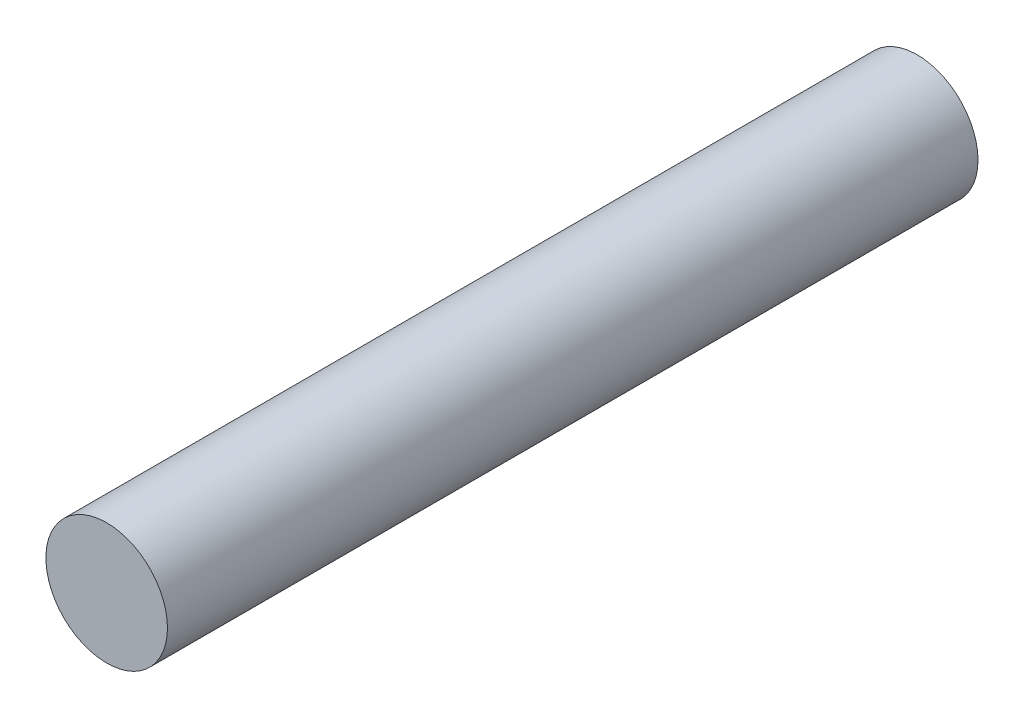
ISO-10303-21;
HEADER;
FILE_DESCRIPTION(('STEP AP214'),'2;1');
FILE_NAME('part.step','',(''),(''),'','','');
FILE_SCHEMA(('AUTOMOTIVE_DESIGN { 1 0 10303 214 1 1 1 1 }'));
ENDSEC;
DATA;
#1=APPLICATION_CONTEXT('core data for automotive mechanical design processes');
#2=APPLICATION_PROTOCOL_DEFINITION('international standard','automotive_design',2000,#1);
#3=PRODUCT_CONTEXT('',#1,'mechanical');
#4=PRODUCT('Part','Part','',(#3));
#5=PRODUCT_RELATED_PRODUCT_CATEGORY('part','',(#4));
#6=PRODUCT_DEFINITION_FORMATION('','',#4);
#7=PRODUCT_DEFINITION_CONTEXT('part definition',#1,'design');
#8=PRODUCT_DEFINITION('design','',#6,#7);
#9=PRODUCT_DEFINITION_SHAPE('','',#8);
#10=(LENGTH_UNIT() NAMED_UNIT(*) SI_UNIT(.MILLI.,.METRE.));
#11=(NAMED_UNIT(*) PLANE_ANGLE_UNIT() SI_UNIT($,.RADIAN.));
#12=(NAMED_UNIT(*) SI_UNIT($,.STERADIAN.) SOLID_ANGLE_UNIT());
#13=UNCERTAINTY_MEASURE_WITH_UNIT(LENGTH_MEASURE(1.E-05),#10,'distance_accuracy_value','');
#14=(GEOMETRIC_REPRESENTATION_CONTEXT(3) GLOBAL_UNCERTAINTY_ASSIGNED_CONTEXT((#13)) GLOBAL_UNIT_ASSIGNED_CONTEXT((#10,
#11,#12)) REPRESENTATION_CONTEXT('',''));
#15=CARTESIAN_POINT('',(0.,0.,0.));
#16=DIRECTION('',(0.,0.,1.));
#17=DIRECTION('',(1.,0.,0.));
#18=AXIS2_PLACEMENT_3D('',#15,#16,#17);
#19=CARTESIAN_POINT('',(0.,0.,-20.));
#20=DIRECTION('',(0.,0.,1.));
#21=DIRECTION('',(-1.,0.,0.));
#22=AXIS2_PLACEMENT_3D('',#19,#20,#21);
#23=CYLINDRICAL_SURFACE('',#22,1.5);
#24=CARTESIAN_POINT('',(0.,0.,-20.));
#25=DIRECTION('',(0.,0.,1.));
#26=DIRECTION('',(1.,0.,0.));
#27=AXIS2_PLACEMENT_3D('',#24,#25,#26);
#28=CIRCLE('',#27,1.5);
#29=CARTESIAN_POINT('',(1.5,0.,-20.));
#30=VERTEX_POINT('',#29);
#31=EDGE_CURVE('E10',#30,#30,#28,.T.);
#32=ORIENTED_EDGE('',*,*,#31,.T.);
#33=EDGE_LOOP('',(#32));
#34=FACE_BOUND('',#33,.T.);
#35=CARTESIAN_POINT('',(0.,0.,0.));
#36=DIRECTION('',(0.,0.,1.));
#37=DIRECTION('',(1.,0.,0.));
#38=AXIS2_PLACEMENT_3D('',#35,#36,#37);
#39=CIRCLE('',#38,1.5);
#40=CARTESIAN_POINT('',(1.5,0.,0.));
#41=VERTEX_POINT('',#40);
#42=EDGE_CURVE('E36',#41,#41,#39,.T.);
#43=ORIENTED_EDGE('',*,*,#42,.F.);
#44=EDGE_LOOP('',(#43));
#45=FACE_BOUND('',#44,.T.);
#46=ADVANCED_FACE('F33',(#34,#45),#23,.T.);
#47=CARTESIAN_POINT('',(0.,0.,-20.));
#48=DIRECTION('',(0.,0.,-1.));
#49=DIRECTION('',(1.,0.,0.));
#50=AXIS2_PLACEMENT_3D('',#47,#48,#49);
#51=PLANE('',#50);
#52=ORIENTED_EDGE('',*,*,#31,.F.);
#53=EDGE_LOOP('',(#52));
#54=FACE_BOUND('',#53,.T.);
#55=ADVANCED_FACE('F48',(#54),#51,.T.);
#56=CARTESIAN_POINT('',(0.,0.,0.));
#57=DIRECTION('',(0.,0.,-1.));
#58=DIRECTION('',(1.,0.,0.));
#59=AXIS2_PLACEMENT_3D('',#56,#57,#58);
#60=PLANE('',#59);
#61=ORIENTED_EDGE('',*,*,#42,.T.);
#62=EDGE_LOOP('',(#61));
#63=FACE_BOUND('',#62,.T.);
#64=ADVANCED_FACE('F45',(#63),#60,.F.);
#65=CLOSED_SHELL('',(#46,#55,#64));
#66=MANIFOLD_SOLID_BREP('B2',#65);
#67=ADVANCED_BREP_SHAPE_REPRESENTATION('',(#18,#66),#14);
#68=SHAPE_DEFINITION_REPRESENTATION(#9,#67);
ENDSEC;
END-ISO-10303-21;
